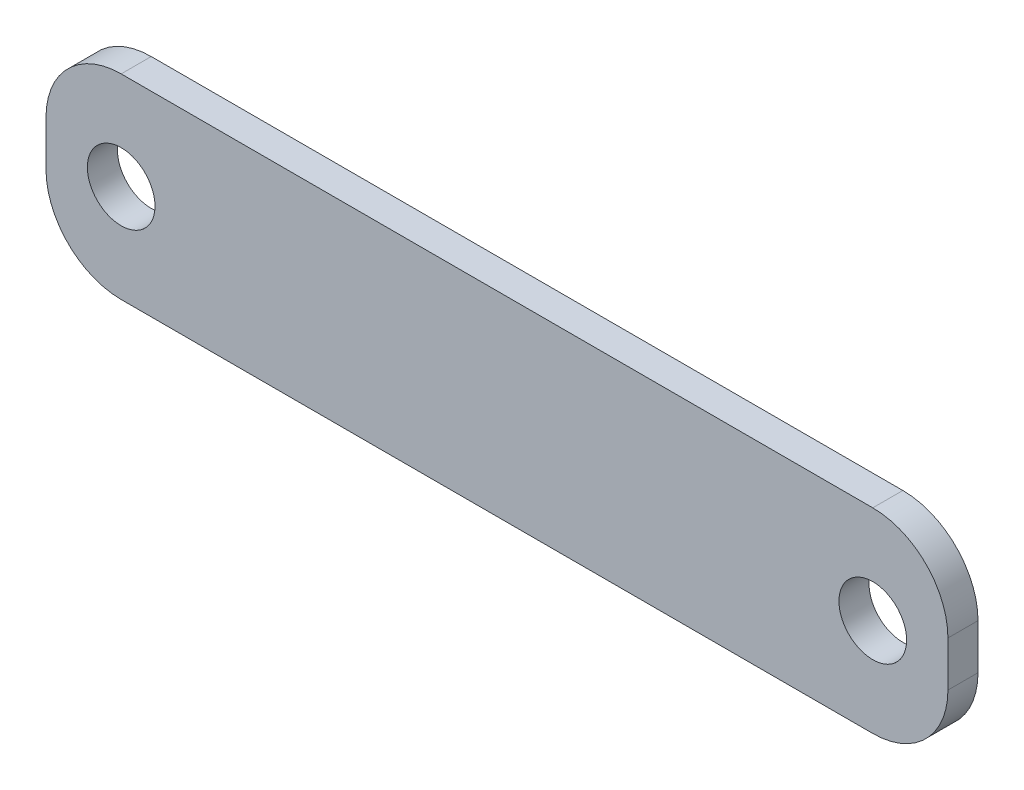
ISO-10303-21;
HEADER;
FILE_DESCRIPTION(('STEP AP214'),'2;1');
FILE_NAME('part.step','',(''),(''),'','','');
FILE_SCHEMA(('AUTOMOTIVE_DESIGN { 1 0 10303 214 1 1 1 1 }'));
ENDSEC;
DATA;
#1=APPLICATION_CONTEXT('core data for automotive mechanical design processes');
#2=APPLICATION_PROTOCOL_DEFINITION('international standard','automotive_design',2000,#1);
#3=PRODUCT_CONTEXT('',#1,'mechanical');
#4=PRODUCT('Part','Part','',(#3));
#5=PRODUCT_RELATED_PRODUCT_CATEGORY('part','',(#4));
#6=PRODUCT_DEFINITION_FORMATION('','',#4);
#7=PRODUCT_DEFINITION_CONTEXT('part definition',#1,'design');
#8=PRODUCT_DEFINITION('design','',#6,#7);
#9=PRODUCT_DEFINITION_SHAPE('','',#8);
#10=(LENGTH_UNIT() NAMED_UNIT(*) SI_UNIT(.MILLI.,.METRE.));
#11=(NAMED_UNIT(*) PLANE_ANGLE_UNIT() SI_UNIT($,.RADIAN.));
#12=(NAMED_UNIT(*) SI_UNIT($,.STERADIAN.) SOLID_ANGLE_UNIT());
#13=UNCERTAINTY_MEASURE_WITH_UNIT(LENGTH_MEASURE(1.E-05),#10,'distance_accuracy_value','');
#14=(GEOMETRIC_REPRESENTATION_CONTEXT(3) GLOBAL_UNCERTAINTY_ASSIGNED_CONTEXT((#13)) GLOBAL_UNIT_ASSIGNED_CONTEXT((#10,
#11,#12)) REPRESENTATION_CONTEXT('',''));
#15=CARTESIAN_POINT('',(0.,0.,0.));
#16=DIRECTION('',(0.,0.,1.));
#17=DIRECTION('',(1.,0.,0.));
#18=AXIS2_PLACEMENT_3D('',#15,#16,#17);
#19=CARTESIAN_POINT('',(50.,1.49999999999983,2.));
#20=DIRECTION('',(0.,0.,-1.));
#21=DIRECTION('',(-1.,0.,0.));
#22=AXIS2_PLACEMENT_3D('',#19,#20,#21);
#23=PLANE('',#22);
#24=CARTESIAN_POINT('',(0.,0.,2.));
#25=DIRECTION('',(0.,0.,1.));
#26=DIRECTION('',(1.,0.,0.));
#27=AXIS2_PLACEMENT_3D('',#24,#25,#26);
#28=CIRCLE('',#27,2.25);
#29=CARTESIAN_POINT('',(2.25,0.,2.));
#30=VERTEX_POINT('',#29);
#31=EDGE_CURVE('E135',#30,#30,#28,.T.);
#32=ORIENTED_EDGE('',*,*,#31,.F.);
#33=EDGE_LOOP('',(#32));
#34=FACE_BOUND('',#33,.T.);
#35=CARTESIAN_POINT('',(50.,1.49999999999983,2.));
#36=DIRECTION('',(0.,0.,1.));
#37=DIRECTION('',(-1.,0.,0.));
#38=AXIS2_PLACEMENT_3D('',#35,#36,#37);
#39=CIRCLE('',#38,5.00000000000017);
#40=CARTESIAN_POINT('',(55.,1.49999999999983,2.));
#41=VERTEX_POINT('',#40);
#42=CARTESIAN_POINT('',(50.,6.50000000000017,2.));
#43=VERTEX_POINT('',#42);
#44=EDGE_CURVE('E146',#41,#43,#39,.T.);
#45=ORIENTED_EDGE('',*,*,#44,.T.);
#46=DIRECTION('',(-1.,0.,0.));
#47=VECTOR('',#46,1.);
#48=CARTESIAN_POINT('',(0.,6.5,2.));
#49=LINE('',#48,#47);
#50=CARTESIAN_POINT('',(0.,6.5,2.));
#51=VERTEX_POINT('',#50);
#52=EDGE_CURVE('E94',#43,#51,#49,.T.);
#53=ORIENTED_EDGE('',*,*,#52,.T.);
#54=CARTESIAN_POINT('',(0.,1.5,2.));
#55=DIRECTION('',(0.,0.,1.));
#56=DIRECTION('',(1.,0.,0.));
#57=AXIS2_PLACEMENT_3D('',#54,#55,#56);
#58=CIRCLE('',#57,5.);
#59=CARTESIAN_POINT('',(-5.,1.49999999999996,2.));
#60=VERTEX_POINT('',#59);
#61=EDGE_CURVE('E161',#51,#60,#58,.T.);
#62=ORIENTED_EDGE('',*,*,#61,.T.);
#63=DIRECTION('',(0.,-1.,0.));
#64=VECTOR('',#63,1.);
#65=CARTESIAN_POINT('',(-5.,1.49999999999996,2.));
#66=LINE('',#65,#64);
#67=CARTESIAN_POINT('',(-5.,-1.50000000000013,2.));
#68=VERTEX_POINT('',#67);
#69=EDGE_CURVE('E174',#60,#68,#66,.T.);
#70=ORIENTED_EDGE('',*,*,#69,.T.);
#71=CARTESIAN_POINT('',(0.,-1.50000000000017,2.));
#72=DIRECTION('',(0.,0.,1.));
#73=DIRECTION('',(1.,0.,0.));
#74=AXIS2_PLACEMENT_3D('',#71,#72,#73);
#75=CIRCLE('',#74,5.);
#76=CARTESIAN_POINT('',(0.,-6.50000000000017,2.));
#77=VERTEX_POINT('',#76);
#78=EDGE_CURVE('E113',#68,#77,#75,.T.);
#79=ORIENTED_EDGE('',*,*,#78,.T.);
#80=DIRECTION('',(1.,0.,0.));
#81=VECTOR('',#80,1.);
#82=CARTESIAN_POINT('',(0.,-6.50000000000017,2.));
#83=LINE('',#82,#81);
#84=CARTESIAN_POINT('',(50.,-6.50000000000017,2.));
#85=VERTEX_POINT('',#84);
#86=EDGE_CURVE('E107',#77,#85,#83,.T.);
#87=ORIENTED_EDGE('',*,*,#86,.T.);
#88=CARTESIAN_POINT('',(50.,-1.49999999999983,2.));
#89=DIRECTION('',(0.,0.,1.));
#90=DIRECTION('',(1.,0.,0.));
#91=AXIS2_PLACEMENT_3D('',#88,#89,#90);
#92=CIRCLE('',#91,5.00000000000017);
#93=CARTESIAN_POINT('',(55.0000000000002,-1.49999999999983,2.));
#94=VERTEX_POINT('',#93);
#95=EDGE_CURVE('E111',#85,#94,#92,.T.);
#96=ORIENTED_EDGE('',*,*,#95,.T.);
#97=DIRECTION('',(0.,1.,0.));
#98=VECTOR('',#97,1.);
#99=CARTESIAN_POINT('',(55.,1.49999999999983,2.));
#100=LINE('',#99,#98);
#101=EDGE_CURVE('E51',#94,#41,#100,.T.);
#102=ORIENTED_EDGE('',*,*,#101,.T.);
#103=EDGE_LOOP('',(#45,#53,#62,#70,#79,#87,#96,#102));
#104=FACE_BOUND('',#103,.T.);
#105=CARTESIAN_POINT('',(50.,0.,2.));
#106=DIRECTION('',(0.,0.,1.));
#107=DIRECTION('',(1.,0.,0.));
#108=AXIS2_PLACEMENT_3D('',#105,#106,#107);
#109=CIRCLE('',#108,2.25);
#110=CARTESIAN_POINT('',(52.25,0.,2.));
#111=VERTEX_POINT('',#110);
#112=EDGE_CURVE('E183',#111,#111,#109,.T.);
#113=ORIENTED_EDGE('',*,*,#112,.F.);
#114=EDGE_LOOP('',(#113));
#115=FACE_BOUND('',#114,.T.);
#116=ADVANCED_FACE('F34',(#34,#104,#115),#23,.F.);
#117=CARTESIAN_POINT('',(50.,1.49999999999983,0.));
#118=DIRECTION('',(0.,0.,-1.));
#119=DIRECTION('',(-1.,0.,0.));
#120=AXIS2_PLACEMENT_3D('',#117,#118,#119);
#121=PLANE('',#120);
#122=CARTESIAN_POINT('',(0.,0.,0.));
#123=DIRECTION('',(0.,0.,1.));
#124=DIRECTION('',(1.,0.,0.));
#125=AXIS2_PLACEMENT_3D('',#122,#123,#124);
#126=CIRCLE('',#125,2.25);
#127=CARTESIAN_POINT('',(2.25,0.,0.));
#128=VERTEX_POINT('',#127);
#129=EDGE_CURVE('E180',#128,#128,#126,.T.);
#130=ORIENTED_EDGE('',*,*,#129,.T.);
#131=EDGE_LOOP('',(#130));
#132=FACE_BOUND('',#131,.T.);
#133=CARTESIAN_POINT('',(50.,1.49999999999983,0.));
#134=DIRECTION('',(0.,0.,1.));
#135=DIRECTION('',(-1.,0.,0.));
#136=AXIS2_PLACEMENT_3D('',#133,#134,#135);
#137=CIRCLE('',#136,5.00000000000017);
#138=CARTESIAN_POINT('',(55.,1.49999999999983,0.));
#139=VERTEX_POINT('',#138);
#140=CARTESIAN_POINT('',(50.,6.50000000000017,0.));
#141=VERTEX_POINT('',#140);
#142=EDGE_CURVE('E131',#139,#141,#137,.T.);
#143=ORIENTED_EDGE('',*,*,#142,.F.);
#144=DIRECTION('',(0.,1.,0.));
#145=VECTOR('',#144,1.);
#146=CARTESIAN_POINT('',(55.,1.49999999999983,0.));
#147=LINE('',#146,#145);
#148=CARTESIAN_POINT('',(55.0000000000002,-1.49999999999983,0.));
#149=VERTEX_POINT('',#148);
#150=EDGE_CURVE('E86',#149,#139,#147,.T.);
#151=ORIENTED_EDGE('',*,*,#150,.F.);
#152=CARTESIAN_POINT('',(50.,-1.49999999999983,0.));
#153=DIRECTION('',(0.,0.,1.));
#154=DIRECTION('',(1.,0.,0.));
#155=AXIS2_PLACEMENT_3D('',#152,#153,#154);
#156=CIRCLE('',#155,5.00000000000017);
#157=CARTESIAN_POINT('',(50.,-6.50000000000017,0.));
#158=VERTEX_POINT('',#157);
#159=EDGE_CURVE('E80',#158,#149,#156,.T.);
#160=ORIENTED_EDGE('',*,*,#159,.F.);
#161=DIRECTION('',(1.,0.,0.));
#162=VECTOR('',#161,1.);
#163=CARTESIAN_POINT('',(0.,-6.50000000000017,0.));
#164=LINE('',#163,#162);
#165=CARTESIAN_POINT('',(0.,-6.50000000000017,0.));
#166=VERTEX_POINT('',#165);
#167=EDGE_CURVE('E121',#166,#158,#164,.T.);
#168=ORIENTED_EDGE('',*,*,#167,.F.);
#169=CARTESIAN_POINT('',(0.,-1.50000000000017,0.));
#170=DIRECTION('',(0.,0.,1.));
#171=DIRECTION('',(1.,0.,0.));
#172=AXIS2_PLACEMENT_3D('',#169,#170,#171);
#173=CIRCLE('',#172,5.);
#174=CARTESIAN_POINT('',(-5.,-1.50000000000013,0.));
#175=VERTEX_POINT('',#174);
#176=EDGE_CURVE('E141',#175,#166,#173,.T.);
#177=ORIENTED_EDGE('',*,*,#176,.F.);
#178=DIRECTION('',(0.,-1.,0.));
#179=VECTOR('',#178,1.);
#180=CARTESIAN_POINT('',(-5.,1.49999999999996,0.));
#181=LINE('',#180,#179);
#182=CARTESIAN_POINT('',(-5.,1.49999999999996,0.));
#183=VERTEX_POINT('',#182);
#184=EDGE_CURVE('E139',#183,#175,#181,.T.);
#185=ORIENTED_EDGE('',*,*,#184,.F.);
#186=CARTESIAN_POINT('',(0.,1.5,0.));
#187=DIRECTION('',(0.,0.,1.));
#188=DIRECTION('',(1.,0.,0.));
#189=AXIS2_PLACEMENT_3D('',#186,#187,#188);
#190=CIRCLE('',#189,5.);
#191=CARTESIAN_POINT('',(0.,6.5,0.));
#192=VERTEX_POINT('',#191);
#193=EDGE_CURVE('E137',#192,#183,#190,.T.);
#194=ORIENTED_EDGE('',*,*,#193,.F.);
#195=DIRECTION('',(-1.,0.,0.));
#196=VECTOR('',#195,1.);
#197=CARTESIAN_POINT('',(0.,6.5,0.));
#198=LINE('',#197,#196);
#199=EDGE_CURVE('E134',#141,#192,#198,.T.);
#200=ORIENTED_EDGE('',*,*,#199,.F.);
#201=EDGE_LOOP('',(#143,#151,#160,#168,#177,#185,#194,#200));
#202=FACE_BOUND('',#201,.T.);
#203=CARTESIAN_POINT('',(50.,0.,0.));
#204=DIRECTION('',(0.,0.,1.));
#205=DIRECTION('',(1.,0.,0.));
#206=AXIS2_PLACEMENT_3D('',#203,#204,#205);
#207=CIRCLE('',#206,2.25);
#208=CARTESIAN_POINT('',(52.25,0.,0.));
#209=VERTEX_POINT('',#208);
#210=EDGE_CURVE('E186',#209,#209,#207,.T.);
#211=ORIENTED_EDGE('',*,*,#210,.T.);
#212=EDGE_LOOP('',(#211));
#213=FACE_BOUND('',#212,.T.);
#214=ADVANCED_FACE('F165',(#132,#202,#213),#121,.T.);
#215=CARTESIAN_POINT('',(50.,1.49999999999983,2.));
#216=DIRECTION('',(0.,0.,-1.));
#217=DIRECTION('',(-1.,0.,0.));
#218=AXIS2_PLACEMENT_3D('',#215,#216,#217);
#219=CYLINDRICAL_SURFACE('',#218,5.00000000000017);
#220=ORIENTED_EDGE('',*,*,#142,.T.);
#221=DIRECTION('',(0.,0.,-1.));
#222=VECTOR('',#221,1.);
#223=CARTESIAN_POINT('',(50.,6.50000000000017,2.));
#224=LINE('',#223,#222);
#225=EDGE_CURVE('E11',#43,#141,#224,.T.);
#226=ORIENTED_EDGE('',*,*,#225,.F.);
#227=ORIENTED_EDGE('',*,*,#44,.F.);
#228=DIRECTION('',(0.,0.,-1.));
#229=VECTOR('',#228,1.);
#230=CARTESIAN_POINT('',(55.,1.49999999999983,2.));
#231=LINE('',#230,#229);
#232=EDGE_CURVE('E127',#41,#139,#231,.T.);
#233=ORIENTED_EDGE('',*,*,#232,.T.);
#234=EDGE_LOOP('',(#220,#226,#227,#233));
#235=FACE_BOUND('',#234,.T.);
#236=ADVANCED_FACE('F36',(#235),#219,.T.);
#237=CARTESIAN_POINT('',(0.,6.5,2.));
#238=DIRECTION('',(0.,-1.,0.));
#239=DIRECTION('',(1.,0.,0.));
#240=AXIS2_PLACEMENT_3D('',#237,#238,#239);
#241=PLANE('',#240);
#242=ORIENTED_EDGE('',*,*,#199,.T.);
#243=DIRECTION('',(0.,0.,-1.));
#244=VECTOR('',#243,1.);
#245=CARTESIAN_POINT('',(0.,6.5,2.));
#246=LINE('',#245,#244);
#247=EDGE_CURVE('E43',#51,#192,#246,.T.);
#248=ORIENTED_EDGE('',*,*,#247,.F.);
#249=ORIENTED_EDGE('',*,*,#52,.F.);
#250=ORIENTED_EDGE('',*,*,#225,.T.);
#251=EDGE_LOOP('',(#242,#248,#249,#250));
#252=FACE_BOUND('',#251,.T.);
#253=ADVANCED_FACE('F219',(#252),#241,.F.);
#254=CARTESIAN_POINT('',(0.,1.5,2.));
#255=DIRECTION('',(0.,0.,-1.));
#256=DIRECTION('',(-1.,0.,0.));
#257=AXIS2_PLACEMENT_3D('',#254,#255,#256);
#258=CYLINDRICAL_SURFACE('',#257,5.);
#259=ORIENTED_EDGE('',*,*,#193,.T.);
#260=DIRECTION('',(0.,0.,-1.));
#261=VECTOR('',#260,1.);
#262=CARTESIAN_POINT('',(-5.,1.49999999999996,2.));
#263=LINE('',#262,#261);
#264=EDGE_CURVE('E153',#60,#183,#263,.T.);
#265=ORIENTED_EDGE('',*,*,#264,.F.);
#266=ORIENTED_EDGE('',*,*,#61,.F.);
#267=ORIENTED_EDGE('',*,*,#247,.T.);
#268=EDGE_LOOP('',(#259,#265,#266,#267));
#269=FACE_BOUND('',#268,.T.);
#270=ADVANCED_FACE('F159',(#269),#258,.T.);
#271=CARTESIAN_POINT('',(-5.,1.49999999999996,2.));
#272=DIRECTION('',(1.,0.,0.));
#273=DIRECTION('',(0.,1.,0.));
#274=AXIS2_PLACEMENT_3D('',#271,#272,#273);
#275=PLANE('',#274);
#276=ORIENTED_EDGE('',*,*,#184,.T.);
#277=DIRECTION('',(0.,0.,-1.));
#278=VECTOR('',#277,1.);
#279=CARTESIAN_POINT('',(-5.,-1.50000000000013,2.));
#280=LINE('',#279,#278);
#281=EDGE_CURVE('E150',#68,#175,#280,.T.);
#282=ORIENTED_EDGE('',*,*,#281,.F.);
#283=ORIENTED_EDGE('',*,*,#69,.F.);
#284=ORIENTED_EDGE('',*,*,#264,.T.);
#285=EDGE_LOOP('',(#276,#282,#283,#284));
#286=FACE_BOUND('',#285,.T.);
#287=ADVANCED_FACE('F170',(#286),#275,.F.);
#288=CARTESIAN_POINT('',(0.,-1.50000000000017,2.));
#289=DIRECTION('',(0.,0.,-1.));
#290=DIRECTION('',(-1.,0.,0.));
#291=AXIS2_PLACEMENT_3D('',#288,#289,#290);
#292=CYLINDRICAL_SURFACE('',#291,5.);
#293=ORIENTED_EDGE('',*,*,#176,.T.);
#294=DIRECTION('',(0.,0.,-1.));
#295=VECTOR('',#294,1.);
#296=CARTESIAN_POINT('',(0.,-6.50000000000017,2.));
#297=LINE('',#296,#295);
#298=EDGE_CURVE('E122',#77,#166,#297,.T.);
#299=ORIENTED_EDGE('',*,*,#298,.F.);
#300=ORIENTED_EDGE('',*,*,#78,.F.);
#301=ORIENTED_EDGE('',*,*,#281,.T.);
#302=EDGE_LOOP('',(#293,#299,#300,#301));
#303=FACE_BOUND('',#302,.T.);
#304=ADVANCED_FACE('F173',(#303),#292,.T.);
#305=CARTESIAN_POINT('',(0.,-6.50000000000017,2.));
#306=DIRECTION('',(0.,1.,0.));
#307=DIRECTION('',(0.,0.,1.));
#308=AXIS2_PLACEMENT_3D('',#305,#306,#307);
#309=PLANE('',#308);
#310=ORIENTED_EDGE('',*,*,#167,.T.);
#311=DIRECTION('',(0.,0.,-1.));
#312=VECTOR('',#311,1.);
#313=CARTESIAN_POINT('',(50.,-6.50000000000017,2.));
#314=LINE('',#313,#312);
#315=EDGE_CURVE('E118',#85,#158,#314,.T.);
#316=ORIENTED_EDGE('',*,*,#315,.F.);
#317=ORIENTED_EDGE('',*,*,#86,.F.);
#318=ORIENTED_EDGE('',*,*,#298,.T.);
#319=EDGE_LOOP('',(#310,#316,#317,#318));
#320=FACE_BOUND('',#319,.T.);
#321=ADVANCED_FACE('F119',(#320),#309,.F.);
#322=CARTESIAN_POINT('',(50.,-1.49999999999983,2.));
#323=DIRECTION('',(0.,0.,-1.));
#324=DIRECTION('',(-1.,0.,0.));
#325=AXIS2_PLACEMENT_3D('',#322,#323,#324);
#326=CYLINDRICAL_SURFACE('',#325,5.00000000000017);
#327=ORIENTED_EDGE('',*,*,#159,.T.);
#328=DIRECTION('',(0.,0.,-1.));
#329=VECTOR('',#328,1.);
#330=CARTESIAN_POINT('',(55.0000000000002,-1.49999999999983,2.));
#331=LINE('',#330,#329);
#332=EDGE_CURVE('E123',#94,#149,#331,.T.);
#333=ORIENTED_EDGE('',*,*,#332,.F.);
#334=ORIENTED_EDGE('',*,*,#95,.F.);
#335=ORIENTED_EDGE('',*,*,#315,.T.);
#336=EDGE_LOOP('',(#327,#333,#334,#335));
#337=FACE_BOUND('',#336,.T.);
#338=ADVANCED_FACE('F125',(#337),#326,.T.);
#339=CARTESIAN_POINT('',(55.,1.49999999999983,2.));
#340=DIRECTION('',(-1.,0.,0.));
#341=DIRECTION('',(0.,0.,1.));
#342=AXIS2_PLACEMENT_3D('',#339,#340,#341);
#343=PLANE('',#342);
#344=ORIENTED_EDGE('',*,*,#150,.T.);
#345=ORIENTED_EDGE('',*,*,#232,.F.);
#346=ORIENTED_EDGE('',*,*,#101,.F.);
#347=ORIENTED_EDGE('',*,*,#332,.T.);
#348=EDGE_LOOP('',(#344,#345,#346,#347));
#349=FACE_BOUND('',#348,.T.);
#350=ADVANCED_FACE('F207',(#349),#343,.F.);
#351=CARTESIAN_POINT('',(0.,0.,2.));
#352=DIRECTION('',(0.,0.,-1.));
#353=DIRECTION('',(-1.,0.,0.));
#354=AXIS2_PLACEMENT_3D('',#351,#352,#353);
#355=CYLINDRICAL_SURFACE('',#354,2.25);
#356=ORIENTED_EDGE('',*,*,#31,.T.);
#357=EDGE_LOOP('',(#356));
#358=FACE_BOUND('',#357,.T.);
#359=ORIENTED_EDGE('',*,*,#129,.F.);
#360=EDGE_LOOP('',(#359));
#361=FACE_BOUND('',#360,.T.);
#362=ADVANCED_FACE('F204',(#358,#361),#355,.F.);
#363=CARTESIAN_POINT('',(50.,0.,2.));
#364=DIRECTION('',(0.,0.,-1.));
#365=DIRECTION('',(-1.,0.,0.));
#366=AXIS2_PLACEMENT_3D('',#363,#364,#365);
#367=CYLINDRICAL_SURFACE('',#366,2.25);
#368=ORIENTED_EDGE('',*,*,#112,.T.);
#369=EDGE_LOOP('',(#368));
#370=FACE_BOUND('',#369,.T.);
#371=ORIENTED_EDGE('',*,*,#210,.F.);
#372=EDGE_LOOP('',(#371));
#373=FACE_BOUND('',#372,.T.);
#374=ADVANCED_FACE('F192',(#370,#373),#367,.F.);
#375=CLOSED_SHELL('',(#116,#214,#236,#253,#270,#287,#304,#321,#338,#350,#362,#374));
#376=MANIFOLD_SOLID_BREP('B2',#375);
#377=ADVANCED_BREP_SHAPE_REPRESENTATION('',(#18,#376),#14);
#378=SHAPE_DEFINITION_REPRESENTATION(#9,#377);
ENDSEC;
END-ISO-10303-21;
